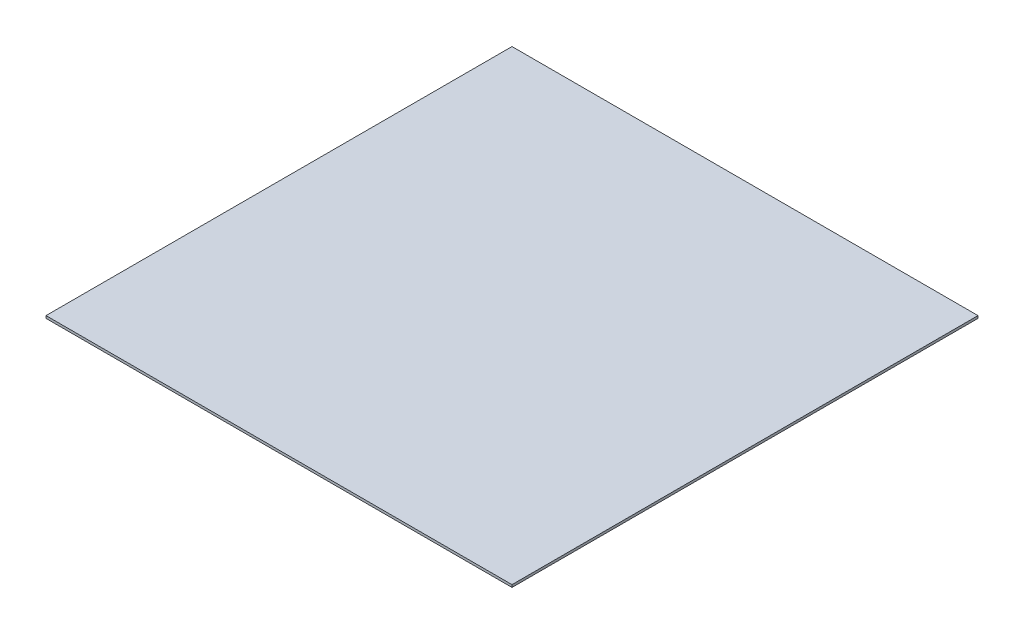
ISO-10303-21;
HEADER;
FILE_DESCRIPTION(('STEP AP214'),'2;1');
FILE_NAME('part.step','',(''),(''),'','','');
FILE_SCHEMA(('AUTOMOTIVE_DESIGN { 1 0 10303 214 1 1 1 1 }'));
ENDSEC;
DATA;
#1=APPLICATION_CONTEXT('core data for automotive mechanical design processes');
#2=APPLICATION_PROTOCOL_DEFINITION('international standard','automotive_design',2000,#1);
#3=PRODUCT_CONTEXT('',#1,'mechanical');
#4=PRODUCT('Part','Part','',(#3));
#5=PRODUCT_RELATED_PRODUCT_CATEGORY('part','',(#4));
#6=PRODUCT_DEFINITION_FORMATION('','',#4);
#7=PRODUCT_DEFINITION_CONTEXT('part definition',#1,'design');
#8=PRODUCT_DEFINITION('design','',#6,#7);
#9=PRODUCT_DEFINITION_SHAPE('','',#8);
#10=(LENGTH_UNIT() NAMED_UNIT(*) SI_UNIT(.MILLI.,.METRE.));
#11=(NAMED_UNIT(*) PLANE_ANGLE_UNIT() SI_UNIT($,.RADIAN.));
#12=(NAMED_UNIT(*) SI_UNIT($,.STERADIAN.) SOLID_ANGLE_UNIT());
#13=UNCERTAINTY_MEASURE_WITH_UNIT(LENGTH_MEASURE(1.E-05),#10,'distance_accuracy_value','');
#14=(GEOMETRIC_REPRESENTATION_CONTEXT(3) GLOBAL_UNCERTAINTY_ASSIGNED_CONTEXT((#13)) GLOBAL_UNIT_ASSIGNED_CONTEXT((#10,
#11,#12)) REPRESENTATION_CONTEXT('',''));
#15=CARTESIAN_POINT('',(0.,0.,0.));
#16=DIRECTION('',(0.,0.,1.));
#17=DIRECTION('',(1.,0.,0.));
#18=AXIS2_PLACEMENT_3D('',#15,#16,#17);
#19=CARTESIAN_POINT('',(0.,100.,0.));
#20=DIRECTION('',(1.,0.,0.));
#21=DIRECTION('',(0.,0.,-1.));
#22=AXIS2_PLACEMENT_3D('',#19,#20,#21);
#23=PLANE('',#22);
#24=DIRECTION('',(0.,0.,1.));
#25=VECTOR('',#24,1.);
#26=CARTESIAN_POINT('',(0.,0.,0.));
#27=LINE('',#26,#25);
#28=CARTESIAN_POINT('',(0.,0.,0.));
#29=VERTEX_POINT('',#28);
#30=CARTESIAN_POINT('',(2.32682891837997E-12,0.,19000.));
#31=VERTEX_POINT('',#30);
#32=EDGE_CURVE('E107',#29,#31,#27,.T.);
#33=ORIENTED_EDGE('',*,*,#32,.T.);
#34=DIRECTION('',(0.,-1.,0.));
#35=VECTOR('',#34,1.);
#36=CARTESIAN_POINT('',(2.32682891837997E-12,100.,19000.));
#37=LINE('',#36,#35);
#38=CARTESIAN_POINT('',(2.32682891837997E-12,100.,19000.));
#39=VERTEX_POINT('',#38);
#40=EDGE_CURVE('E11',#39,#31,#37,.T.);
#41=ORIENTED_EDGE('',*,*,#40,.F.);
#42=DIRECTION('',(0.,0.,1.));
#43=VECTOR('',#42,1.);
#44=CARTESIAN_POINT('',(0.,100.,0.));
#45=LINE('',#44,#43);
#46=CARTESIAN_POINT('',(0.,100.,0.));
#47=VERTEX_POINT('',#46);
#48=EDGE_CURVE('E91',#47,#39,#45,.T.);
#49=ORIENTED_EDGE('',*,*,#48,.F.);
#50=DIRECTION('',(0.,-1.,0.));
#51=VECTOR('',#50,1.);
#52=CARTESIAN_POINT('',(0.,100.,0.));
#53=LINE('',#52,#51);
#54=EDGE_CURVE('E103',#47,#29,#53,.T.);
#55=ORIENTED_EDGE('',*,*,#54,.T.);
#56=EDGE_LOOP('',(#33,#41,#49,#55));
#57=FACE_BOUND('',#56,.T.);
#58=ADVANCED_FACE('F39',(#57),#23,.F.);
#59=CARTESIAN_POINT('',(2.32682891837997E-12,100.,19000.));
#60=DIRECTION('',(0.,0.,-1.));
#61=DIRECTION('',(-1.,0.,0.));
#62=AXIS2_PLACEMENT_3D('',#59,#60,#61);
#63=PLANE('',#62);
#64=DIRECTION('',(1.,0.,0.));
#65=VECTOR('',#64,1.);
#66=CARTESIAN_POINT('',(2.32682891837997E-12,0.,19000.));
#67=LINE('',#66,#65);
#68=CARTESIAN_POINT('',(19000.,0.,19000.));
#69=VERTEX_POINT('',#68);
#70=EDGE_CURVE('E96',#31,#69,#67,.T.);
#71=ORIENTED_EDGE('',*,*,#70,.T.);
#72=DIRECTION('',(0.,-1.,0.));
#73=VECTOR('',#72,1.);
#74=CARTESIAN_POINT('',(19000.,100.,19000.));
#75=LINE('',#74,#73);
#76=CARTESIAN_POINT('',(19000.,100.,19000.));
#77=VERTEX_POINT('',#76);
#78=EDGE_CURVE('E48',#77,#69,#75,.T.);
#79=ORIENTED_EDGE('',*,*,#78,.F.);
#80=DIRECTION('',(1.,0.,0.));
#81=VECTOR('',#80,1.);
#82=CARTESIAN_POINT('',(2.32682891837997E-12,100.,19000.));
#83=LINE('',#82,#81);
#84=EDGE_CURVE('E86',#39,#77,#83,.T.);
#85=ORIENTED_EDGE('',*,*,#84,.F.);
#86=ORIENTED_EDGE('',*,*,#40,.T.);
#87=EDGE_LOOP('',(#71,#79,#85,#86));
#88=FACE_BOUND('',#87,.T.);
#89=ADVANCED_FACE('F95',(#88),#63,.F.);
#90=CARTESIAN_POINT('',(19000.,100.,0.));
#91=DIRECTION('',(-1.,0.,0.));
#92=DIRECTION('',(0.,0.,1.));
#93=AXIS2_PLACEMENT_3D('',#90,#91,#92);
#94=PLANE('',#93);
#95=DIRECTION('',(0.,0.,-1.));
#96=VECTOR('',#95,1.);
#97=CARTESIAN_POINT('',(19000.,0.,0.));
#98=LINE('',#97,#96);
#99=CARTESIAN_POINT('',(19000.,0.,0.));
#100=VERTEX_POINT('',#99);
#101=EDGE_CURVE('E73',#69,#100,#98,.T.);
#102=ORIENTED_EDGE('',*,*,#101,.T.);
#103=DIRECTION('',(0.,-1.,0.));
#104=VECTOR('',#103,1.);
#105=CARTESIAN_POINT('',(19000.,100.,0.));
#106=LINE('',#105,#104);
#107=CARTESIAN_POINT('',(19000.,100.,0.));
#108=VERTEX_POINT('',#107);
#109=EDGE_CURVE('E98',#108,#100,#106,.T.);
#110=ORIENTED_EDGE('',*,*,#109,.F.);
#111=DIRECTION('',(0.,0.,-1.));
#112=VECTOR('',#111,1.);
#113=CARTESIAN_POINT('',(19000.,100.,0.));
#114=LINE('',#113,#112);
#115=EDGE_CURVE('E89',#77,#108,#114,.T.);
#116=ORIENTED_EDGE('',*,*,#115,.F.);
#117=ORIENTED_EDGE('',*,*,#78,.T.);
#118=EDGE_LOOP('',(#102,#110,#116,#117));
#119=FACE_BOUND('',#118,.T.);
#120=ADVANCED_FACE('F99',(#119),#94,.F.);
#121=CARTESIAN_POINT('',(0.,100.,0.));
#122=DIRECTION('',(0.,0.,1.));
#123=DIRECTION('',(1.,0.,0.));
#124=AXIS2_PLACEMENT_3D('',#121,#122,#123);
#125=PLANE('',#124);
#126=DIRECTION('',(-1.,0.,0.));
#127=VECTOR('',#126,1.);
#128=CARTESIAN_POINT('',(0.,0.,0.));
#129=LINE('',#128,#127);
#130=EDGE_CURVE('E79',#100,#29,#129,.T.);
#131=ORIENTED_EDGE('',*,*,#130,.T.);
#132=ORIENTED_EDGE('',*,*,#54,.F.);
#133=DIRECTION('',(-1.,0.,0.));
#134=VECTOR('',#133,1.);
#135=CARTESIAN_POINT('',(0.,100.,0.));
#136=LINE('',#135,#134);
#137=EDGE_CURVE('E56',#108,#47,#136,.T.);
#138=ORIENTED_EDGE('',*,*,#137,.F.);
#139=ORIENTED_EDGE('',*,*,#109,.T.);
#140=EDGE_LOOP('',(#131,#132,#138,#139));
#141=FACE_BOUND('',#140,.T.);
#142=ADVANCED_FACE('F120',(#141),#125,.F.);
#143=CARTESIAN_POINT('',(0.,100.,0.));
#144=DIRECTION('',(0.,1.,0.));
#145=DIRECTION('',(0.,0.,1.));
#146=AXIS2_PLACEMENT_3D('',#143,#144,#145);
#147=PLANE('',#146);
#148=ORIENTED_EDGE('',*,*,#48,.T.);
#149=ORIENTED_EDGE('',*,*,#84,.T.);
#150=ORIENTED_EDGE('',*,*,#115,.T.);
#151=ORIENTED_EDGE('',*,*,#137,.T.);
#152=EDGE_LOOP('',(#148,#149,#150,#151));
#153=FACE_BOUND('',#152,.T.);
#154=ADVANCED_FACE('F87',(#153),#147,.T.);
#155=CARTESIAN_POINT('',(0.,0.,0.));
#156=DIRECTION('',(0.,1.,0.));
#157=DIRECTION('',(0.,0.,1.));
#158=AXIS2_PLACEMENT_3D('',#155,#156,#157);
#159=PLANE('',#158);
#160=ORIENTED_EDGE('',*,*,#32,.F.);
#161=ORIENTED_EDGE('',*,*,#130,.F.);
#162=ORIENTED_EDGE('',*,*,#101,.F.);
#163=ORIENTED_EDGE('',*,*,#70,.F.);
#164=EDGE_LOOP('',(#160,#161,#162,#163));
#165=FACE_BOUND('',#164,.T.);
#166=ADVANCED_FACE('F123',(#165),#159,.F.);
#167=CLOSED_SHELL('',(#58,#89,#120,#142,#154,#166));
#168=MANIFOLD_SOLID_BREP('B2',#167);
#169=ADVANCED_BREP_SHAPE_REPRESENTATION('',(#18,#168),#14);
#170=SHAPE_DEFINITION_REPRESENTATION(#9,#169);
ENDSEC;
END-ISO-10303-21;
